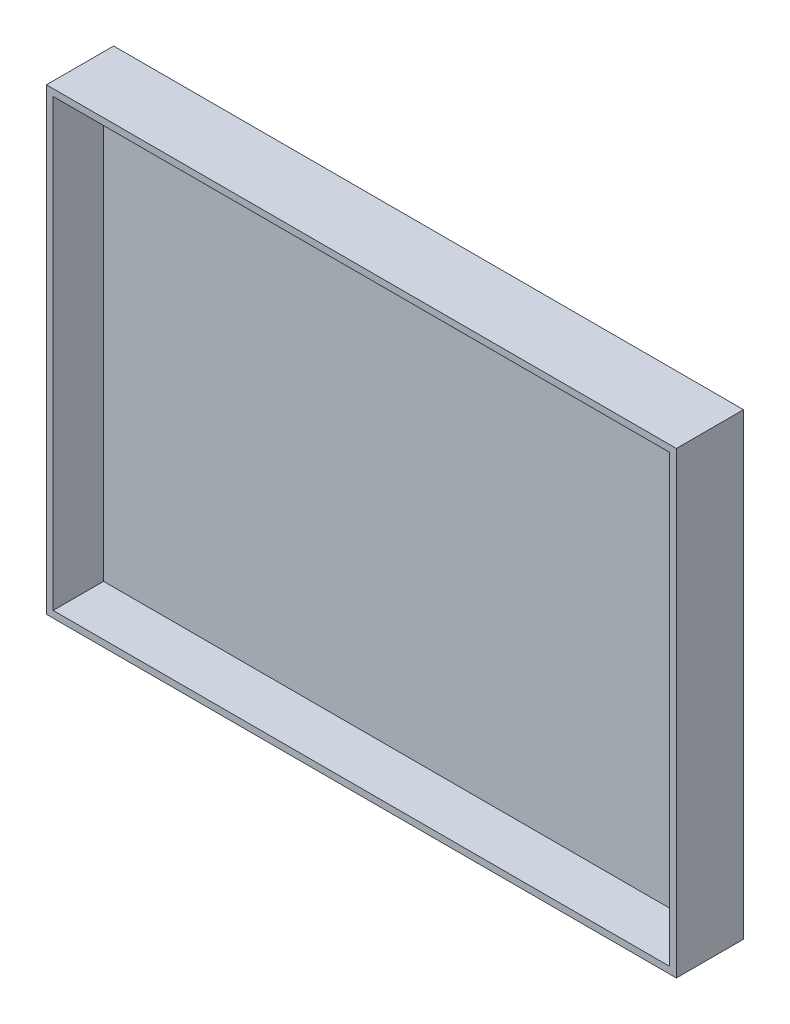
ISO-10303-21;
HEADER;
FILE_DESCRIPTION(('STEP AP214'),'2;1');
FILE_NAME('part.step','',(''),(''),'','','');
FILE_SCHEMA(('AUTOMOTIVE_DESIGN { 1 0 10303 214 1 1 1 1 }'));
ENDSEC;
DATA;
#1=APPLICATION_CONTEXT('core data for automotive mechanical design processes');
#2=APPLICATION_PROTOCOL_DEFINITION('international standard','automotive_design',2000,#1);
#3=PRODUCT_CONTEXT('',#1,'mechanical');
#4=PRODUCT('Part','Part','',(#3));
#5=PRODUCT_RELATED_PRODUCT_CATEGORY('part','',(#4));
#6=PRODUCT_DEFINITION_FORMATION('','',#4);
#7=PRODUCT_DEFINITION_CONTEXT('part definition',#1,'design');
#8=PRODUCT_DEFINITION('design','',#6,#7);
#9=PRODUCT_DEFINITION_SHAPE('','',#8);
#10=(LENGTH_UNIT() NAMED_UNIT(*) SI_UNIT(.MILLI.,.METRE.));
#11=(NAMED_UNIT(*) PLANE_ANGLE_UNIT() SI_UNIT($,.RADIAN.));
#12=(NAMED_UNIT(*) SI_UNIT($,.STERADIAN.) SOLID_ANGLE_UNIT());
#13=UNCERTAINTY_MEASURE_WITH_UNIT(LENGTH_MEASURE(1.E-05),#10,'distance_accuracy_value','');
#14=(GEOMETRIC_REPRESENTATION_CONTEXT(3) GLOBAL_UNCERTAINTY_ASSIGNED_CONTEXT((#13)) GLOBAL_UNIT_ASSIGNED_CONTEXT((#10,
#11,#12)) REPRESENTATION_CONTEXT('',''));
#15=CARTESIAN_POINT('',(0.,0.,0.));
#16=DIRECTION('',(0.,0.,1.));
#17=DIRECTION('',(1.,0.,0.));
#18=AXIS2_PLACEMENT_3D('',#15,#16,#17);
#19=CARTESIAN_POINT('',(0.,0.,1.));
#20=DIRECTION('',(0.,0.,1.));
#21=DIRECTION('',(1.,0.,0.));
#22=AXIS2_PLACEMENT_3D('',#19,#20,#21);
#23=PLANE('',#22);
#24=DIRECTION('',(0.,1.,0.));
#25=VECTOR('',#24,1.);
#26=CARTESIAN_POINT('',(18.35,13.25,1.));
#27=LINE('',#26,#25);
#28=CARTESIAN_POINT('',(18.35,-13.25,1.));
#29=VERTEX_POINT('',#28);
#30=CARTESIAN_POINT('',(18.35,13.25,1.));
#31=VERTEX_POINT('',#30);
#32=EDGE_CURVE('E184',#29,#31,#27,.T.);
#33=ORIENTED_EDGE('',*,*,#32,.T.);
#34=DIRECTION('',(-1.,0.,0.));
#35=VECTOR('',#34,1.);
#36=CARTESIAN_POINT('',(-18.35,13.25,1.));
#37=LINE('',#36,#35);
#38=CARTESIAN_POINT('',(-18.35,13.25,1.));
#39=VERTEX_POINT('',#38);
#40=EDGE_CURVE('E84',#31,#39,#37,.T.);
#41=ORIENTED_EDGE('',*,*,#40,.T.);
#42=DIRECTION('',(0.,-1.,0.));
#43=VECTOR('',#42,1.);
#44=CARTESIAN_POINT('',(-18.35,13.25,1.));
#45=LINE('',#44,#43);
#46=CARTESIAN_POINT('',(-18.35,-13.25,1.));
#47=VERTEX_POINT('',#46);
#48=EDGE_CURVE('E69',#39,#47,#45,.T.);
#49=ORIENTED_EDGE('',*,*,#48,.T.);
#50=DIRECTION('',(1.,0.,0.));
#51=VECTOR('',#50,1.);
#52=CARTESIAN_POINT('',(-18.35,-13.25,1.));
#53=LINE('',#52,#51);
#54=EDGE_CURVE('E12',#47,#29,#53,.T.);
#55=ORIENTED_EDGE('',*,*,#54,.T.);
#56=EDGE_LOOP('',(#33,#41,#49,#55));
#57=FACE_BOUND('',#56,.T.);
#58=ADVANCED_FACE('F61',(#57),#23,.T.);
#59=CARTESIAN_POINT('',(0.,0.,4.));
#60=DIRECTION('',(0.,0.,1.));
#61=DIRECTION('',(1.,0.,0.));
#62=AXIS2_PLACEMENT_3D('',#59,#60,#61);
#63=PLANE('',#62);
#64=DIRECTION('',(0.,1.,0.));
#65=VECTOR('',#64,1.);
#66=CARTESIAN_POINT('',(18.75,13.25,4.));
#67=LINE('',#66,#65);
#68=CARTESIAN_POINT('',(18.75,-13.65,4.));
#69=VERTEX_POINT('',#68);
#70=CARTESIAN_POINT('',(18.75,13.65,4.));
#71=VERTEX_POINT('',#70);
#72=EDGE_CURVE('E155',#69,#71,#67,.T.);
#73=ORIENTED_EDGE('',*,*,#72,.T.);
#74=DIRECTION('',(-1.,0.,0.));
#75=VECTOR('',#74,1.);
#76=CARTESIAN_POINT('',(-18.35,13.65,4.));
#77=LINE('',#76,#75);
#78=CARTESIAN_POINT('',(-18.75,13.65,4.));
#79=VERTEX_POINT('',#78);
#80=EDGE_CURVE('E158',#71,#79,#77,.T.);
#81=ORIENTED_EDGE('',*,*,#80,.T.);
#82=DIRECTION('',(0.,-1.,0.));
#83=VECTOR('',#82,1.);
#84=CARTESIAN_POINT('',(-18.75,13.25,4.));
#85=LINE('',#84,#83);
#86=CARTESIAN_POINT('',(-18.75,-13.65,4.));
#87=VERTEX_POINT('',#86);
#88=EDGE_CURVE('E161',#79,#87,#85,.T.);
#89=ORIENTED_EDGE('',*,*,#88,.T.);
#90=DIRECTION('',(1.,0.,0.));
#91=VECTOR('',#90,1.);
#92=CARTESIAN_POINT('',(-18.35,-13.65,4.));
#93=LINE('',#92,#91);
#94=EDGE_CURVE('E163',#87,#69,#93,.T.);
#95=ORIENTED_EDGE('',*,*,#94,.T.);
#96=EDGE_LOOP('',(#73,#81,#89,#95));
#97=FACE_BOUND('',#96,.T.);
#98=DIRECTION('',(-1.,0.,0.));
#99=VECTOR('',#98,1.);
#100=CARTESIAN_POINT('',(-18.35,13.25,4.));
#101=LINE('',#100,#99);
#102=CARTESIAN_POINT('',(18.35,13.25,4.));
#103=VERTEX_POINT('',#102);
#104=CARTESIAN_POINT('',(-18.35,13.25,4.));
#105=VERTEX_POINT('',#104);
#106=EDGE_CURVE('E134',#103,#105,#101,.T.);
#107=ORIENTED_EDGE('',*,*,#106,.F.);
#108=DIRECTION('',(0.,1.,0.));
#109=VECTOR('',#108,1.);
#110=CARTESIAN_POINT('',(18.35,13.25,4.));
#111=LINE('',#110,#109);
#112=CARTESIAN_POINT('',(18.35,-13.25,4.));
#113=VERTEX_POINT('',#112);
#114=EDGE_CURVE('E127',#113,#103,#111,.T.);
#115=ORIENTED_EDGE('',*,*,#114,.F.);
#116=DIRECTION('',(1.,0.,0.));
#117=VECTOR('',#116,1.);
#118=CARTESIAN_POINT('',(-18.35,-13.25,4.));
#119=LINE('',#118,#117);
#120=CARTESIAN_POINT('',(-18.35,-13.25,4.));
#121=VERTEX_POINT('',#120);
#122=EDGE_CURVE('E146',#121,#113,#119,.T.);
#123=ORIENTED_EDGE('',*,*,#122,.F.);
#124=DIRECTION('',(0.,-1.,0.));
#125=VECTOR('',#124,1.);
#126=CARTESIAN_POINT('',(-18.35,13.25,4.));
#127=LINE('',#126,#125);
#128=EDGE_CURVE('E144',#105,#121,#127,.T.);
#129=ORIENTED_EDGE('',*,*,#128,.F.);
#130=EDGE_LOOP('',(#107,#115,#123,#129));
#131=FACE_BOUND('',#130,.T.);
#132=ADVANCED_FACE('F142',(#97,#131),#63,.T.);
#133=CARTESIAN_POINT('',(18.75,13.25,4.));
#134=DIRECTION('',(-1.,0.,0.));
#135=DIRECTION('',(0.,0.,1.));
#136=AXIS2_PLACEMENT_3D('',#133,#134,#135);
#137=PLANE('',#136);
#138=DIRECTION('',(0.,1.,0.));
#139=VECTOR('',#138,1.);
#140=CARTESIAN_POINT('',(18.75,13.25,0.));
#141=LINE('',#140,#139);
#142=CARTESIAN_POINT('',(18.75,-13.65,0.));
#143=VERTEX_POINT('',#142);
#144=CARTESIAN_POINT('',(18.75,13.65,0.));
#145=VERTEX_POINT('',#144);
#146=EDGE_CURVE('E138',#143,#145,#141,.T.);
#147=ORIENTED_EDGE('',*,*,#146,.T.);
#148=DIRECTION('',(0.,0.,-1.));
#149=VECTOR('',#148,1.);
#150=CARTESIAN_POINT('',(18.75,13.65,4.));
#151=LINE('',#150,#149);
#152=EDGE_CURVE('E181',#71,#145,#151,.T.);
#153=ORIENTED_EDGE('',*,*,#152,.F.);
#154=ORIENTED_EDGE('',*,*,#72,.F.);
#155=DIRECTION('',(0.,0.,-1.));
#156=VECTOR('',#155,1.);
#157=CARTESIAN_POINT('',(18.75,-13.65,4.));
#158=LINE('',#157,#156);
#159=EDGE_CURVE('E165',#69,#143,#158,.T.);
#160=ORIENTED_EDGE('',*,*,#159,.T.);
#161=EDGE_LOOP('',(#147,#153,#154,#160));
#162=FACE_BOUND('',#161,.T.);
#163=ADVANCED_FACE('F203',(#162),#137,.F.);
#164=CARTESIAN_POINT('',(-18.35,13.65,4.));
#165=DIRECTION('',(0.,-1.,0.));
#166=DIRECTION('',(0.,0.,-1.));
#167=AXIS2_PLACEMENT_3D('',#164,#165,#166);
#168=PLANE('',#167);
#169=DIRECTION('',(-1.,0.,0.));
#170=VECTOR('',#169,1.);
#171=CARTESIAN_POINT('',(-18.35,13.65,0.));
#172=LINE('',#171,#170);
#173=CARTESIAN_POINT('',(-18.75,13.65,0.));
#174=VERTEX_POINT('',#173);
#175=EDGE_CURVE('E168',#145,#174,#172,.T.);
#176=ORIENTED_EDGE('',*,*,#175,.T.);
#177=DIRECTION('',(0.,0.,-1.));
#178=VECTOR('',#177,1.);
#179=CARTESIAN_POINT('',(-18.75,13.65,4.));
#180=LINE('',#179,#178);
#181=EDGE_CURVE('E178',#79,#174,#180,.T.);
#182=ORIENTED_EDGE('',*,*,#181,.F.);
#183=ORIENTED_EDGE('',*,*,#80,.F.);
#184=ORIENTED_EDGE('',*,*,#152,.T.);
#185=EDGE_LOOP('',(#176,#182,#183,#184));
#186=FACE_BOUND('',#185,.T.);
#187=ADVANCED_FACE('F209',(#186),#168,.F.);
#188=CARTESIAN_POINT('',(-18.75,13.25,4.));
#189=DIRECTION('',(1.,0.,0.));
#190=DIRECTION('',(0.,1.,0.));
#191=AXIS2_PLACEMENT_3D('',#188,#189,#190);
#192=PLANE('',#191);
#193=DIRECTION('',(0.,-1.,0.));
#194=VECTOR('',#193,1.);
#195=CARTESIAN_POINT('',(-18.75,13.25,0.));
#196=LINE('',#195,#194);
#197=CARTESIAN_POINT('',(-18.75,-13.65,0.));
#198=VERTEX_POINT('',#197);
#199=EDGE_CURVE('E170',#174,#198,#196,.T.);
#200=ORIENTED_EDGE('',*,*,#199,.T.);
#201=DIRECTION('',(0.,0.,-1.));
#202=VECTOR('',#201,1.);
#203=CARTESIAN_POINT('',(-18.75,-13.65,4.));
#204=LINE('',#203,#202);
#205=EDGE_CURVE('E175',#87,#198,#204,.T.);
#206=ORIENTED_EDGE('',*,*,#205,.F.);
#207=ORIENTED_EDGE('',*,*,#88,.F.);
#208=ORIENTED_EDGE('',*,*,#181,.T.);
#209=EDGE_LOOP('',(#200,#206,#207,#208));
#210=FACE_BOUND('',#209,.T.);
#211=ADVANCED_FACE('F213',(#210),#192,.F.);
#212=CARTESIAN_POINT('',(-18.35,-13.65,4.));
#213=DIRECTION('',(0.,1.,0.));
#214=DIRECTION('',(0.,0.,1.));
#215=AXIS2_PLACEMENT_3D('',#212,#213,#214);
#216=PLANE('',#215);
#217=DIRECTION('',(1.,0.,0.));
#218=VECTOR('',#217,1.);
#219=CARTESIAN_POINT('',(-18.35,-13.65,0.));
#220=LINE('',#219,#218);
#221=EDGE_CURVE('E159',#198,#143,#220,.T.);
#222=ORIENTED_EDGE('',*,*,#221,.T.);
#223=ORIENTED_EDGE('',*,*,#159,.F.);
#224=ORIENTED_EDGE('',*,*,#94,.F.);
#225=ORIENTED_EDGE('',*,*,#205,.T.);
#226=EDGE_LOOP('',(#222,#223,#224,#225));
#227=FACE_BOUND('',#226,.T.);
#228=ADVANCED_FACE('F217',(#227),#216,.F.);
#229=CARTESIAN_POINT('',(18.35,13.25,4.));
#230=DIRECTION('',(-1.,0.,0.));
#231=DIRECTION('',(0.,0.,1.));
#232=AXIS2_PLACEMENT_3D('',#229,#230,#231);
#233=PLANE('',#232);
#234=DIRECTION('',(0.,0.,-1.));
#235=VECTOR('',#234,1.);
#236=CARTESIAN_POINT('',(18.35,13.25,4.));
#237=LINE('',#236,#235);
#238=EDGE_CURVE('E129',#103,#31,#237,.T.);
#239=ORIENTED_EDGE('',*,*,#238,.T.);
#240=ORIENTED_EDGE('',*,*,#32,.F.);
#241=DIRECTION('',(0.,0.,-1.));
#242=VECTOR('',#241,1.);
#243=CARTESIAN_POINT('',(18.35,-13.25,4.));
#244=LINE('',#243,#242);
#245=EDGE_CURVE('E76',#113,#29,#244,.T.);
#246=ORIENTED_EDGE('',*,*,#245,.F.);
#247=ORIENTED_EDGE('',*,*,#114,.T.);
#248=EDGE_LOOP('',(#239,#240,#246,#247));
#249=FACE_BOUND('',#248,.T.);
#250=ADVANCED_FACE('F128',(#249),#233,.T.);
#251=CARTESIAN_POINT('',(-18.35,13.25,4.));
#252=DIRECTION('',(0.,-1.,0.));
#253=DIRECTION('',(0.,0.,-1.));
#254=AXIS2_PLACEMENT_3D('',#251,#252,#253);
#255=PLANE('',#254);
#256=DIRECTION('',(0.,0.,-1.));
#257=VECTOR('',#256,1.);
#258=CARTESIAN_POINT('',(-18.35,13.25,4.));
#259=LINE('',#258,#257);
#260=EDGE_CURVE('E139',#105,#39,#259,.T.);
#261=ORIENTED_EDGE('',*,*,#260,.T.);
#262=ORIENTED_EDGE('',*,*,#40,.F.);
#263=ORIENTED_EDGE('',*,*,#238,.F.);
#264=ORIENTED_EDGE('',*,*,#106,.T.);
#265=EDGE_LOOP('',(#261,#262,#263,#264));
#266=FACE_BOUND('',#265,.T.);
#267=ADVANCED_FACE('F136',(#266),#255,.T.);
#268=CARTESIAN_POINT('',(-18.35,13.25,4.));
#269=DIRECTION('',(1.,0.,0.));
#270=DIRECTION('',(0.,1.,0.));
#271=AXIS2_PLACEMENT_3D('',#268,#269,#270);
#272=PLANE('',#271);
#273=DIRECTION('',(0.,0.,-1.));
#274=VECTOR('',#273,1.);
#275=CARTESIAN_POINT('',(-18.35,-13.25,4.));
#276=LINE('',#275,#274);
#277=EDGE_CURVE('E151',#121,#47,#276,.T.);
#278=ORIENTED_EDGE('',*,*,#277,.T.);
#279=ORIENTED_EDGE('',*,*,#48,.F.);
#280=ORIENTED_EDGE('',*,*,#260,.F.);
#281=ORIENTED_EDGE('',*,*,#128,.T.);
#282=EDGE_LOOP('',(#278,#279,#280,#281));
#283=FACE_BOUND('',#282,.T.);
#284=ADVANCED_FACE('F189',(#283),#272,.T.);
#285=CARTESIAN_POINT('',(-18.35,-13.25,4.));
#286=DIRECTION('',(0.,1.,0.));
#287=DIRECTION('',(0.,0.,1.));
#288=AXIS2_PLACEMENT_3D('',#285,#286,#287);
#289=PLANE('',#288);
#290=ORIENTED_EDGE('',*,*,#245,.T.);
#291=ORIENTED_EDGE('',*,*,#54,.F.);
#292=ORIENTED_EDGE('',*,*,#277,.F.);
#293=ORIENTED_EDGE('',*,*,#122,.T.);
#294=EDGE_LOOP('',(#290,#291,#292,#293));
#295=FACE_BOUND('',#294,.T.);
#296=ADVANCED_FACE('F190',(#295),#289,.T.);
#297=CARTESIAN_POINT('',(0.,0.,0.));
#298=DIRECTION('',(0.,0.,1.));
#299=DIRECTION('',(1.,0.,0.));
#300=AXIS2_PLACEMENT_3D('',#297,#298,#299);
#301=PLANE('',#300);
#302=ORIENTED_EDGE('',*,*,#146,.F.);
#303=ORIENTED_EDGE('',*,*,#221,.F.);
#304=ORIENTED_EDGE('',*,*,#199,.F.);
#305=ORIENTED_EDGE('',*,*,#175,.F.);
#306=EDGE_LOOP('',(#302,#303,#304,#305));
#307=FACE_BOUND('',#306,.T.);
#308=ADVANCED_FACE('F63',(#307),#301,.F.);
#309=CLOSED_SHELL('',(#58,#132,#163,#187,#211,#228,#250,#267,#284,#296,#308));
#310=MANIFOLD_SOLID_BREP('B2',#309);
#311=ADVANCED_BREP_SHAPE_REPRESENTATION('',(#18,#310),#14);
#312=SHAPE_DEFINITION_REPRESENTATION(#9,#311);
ENDSEC;
END-ISO-10303-21;
